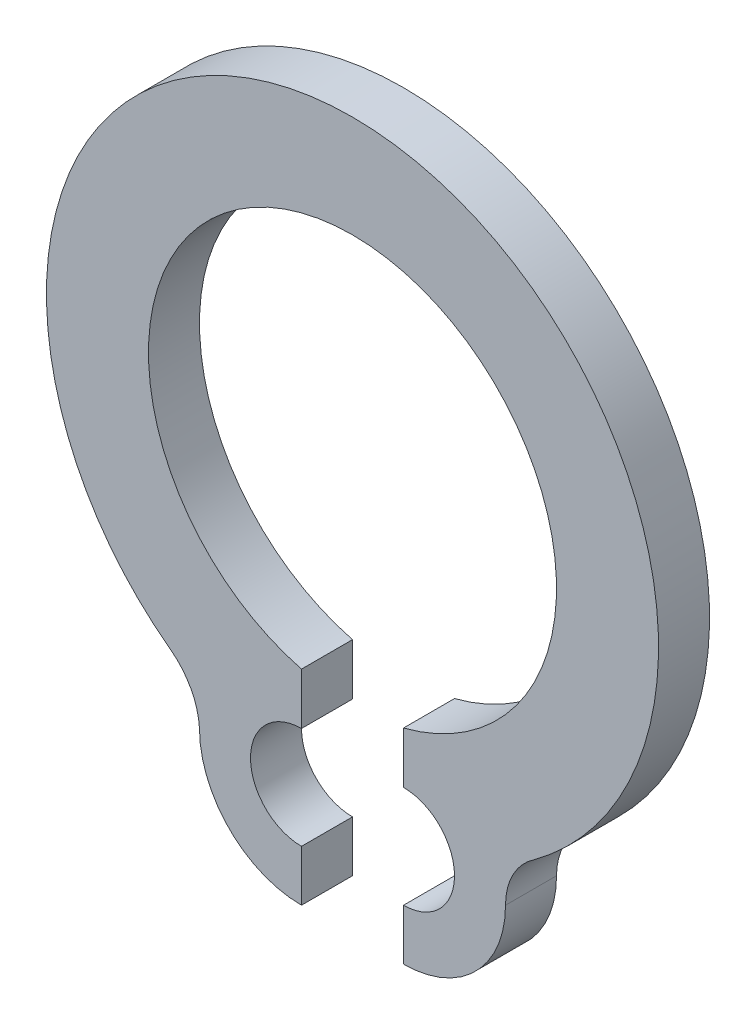
ISO-10303-21;
HEADER;
FILE_DESCRIPTION(('STEP AP214'),'2;1');
FILE_NAME('part.step','',(''),(''),'','','');
FILE_SCHEMA(('AUTOMOTIVE_DESIGN { 1 0 10303 214 1 1 1 1 }'));
ENDSEC;
DATA;
#1=APPLICATION_CONTEXT('core data for automotive mechanical design processes');
#2=APPLICATION_PROTOCOL_DEFINITION('international standard','automotive_design',2000,#1);
#3=PRODUCT_CONTEXT('',#1,'mechanical');
#4=PRODUCT('Part','Part','',(#3));
#5=PRODUCT_RELATED_PRODUCT_CATEGORY('part','',(#4));
#6=PRODUCT_DEFINITION_FORMATION('','',#4);
#7=PRODUCT_DEFINITION_CONTEXT('part definition',#1,'design');
#8=PRODUCT_DEFINITION('design','',#6,#7);
#9=PRODUCT_DEFINITION_SHAPE('','',#8);
#10=(LENGTH_UNIT() NAMED_UNIT(*) SI_UNIT(.MILLI.,.METRE.));
#11=(NAMED_UNIT(*) PLANE_ANGLE_UNIT() SI_UNIT($,.RADIAN.));
#12=(NAMED_UNIT(*) SI_UNIT($,.STERADIAN.) SOLID_ANGLE_UNIT());
#13=UNCERTAINTY_MEASURE_WITH_UNIT(LENGTH_MEASURE(1.E-05),#10,'distance_accuracy_value','');
#14=(GEOMETRIC_REPRESENTATION_CONTEXT(3) GLOBAL_UNCERTAINTY_ASSIGNED_CONTEXT((#13)) GLOBAL_UNIT_ASSIGNED_CONTEXT((#10,
#11,#12)) REPRESENTATION_CONTEXT('',''));
#15=CARTESIAN_POINT('',(0.,0.,0.));
#16=DIRECTION('',(0.,0.,1.));
#17=DIRECTION('',(1.,0.,0.));
#18=AXIS2_PLACEMENT_3D('',#15,#16,#17);
#19=CARTESIAN_POINT('',(0.,0.,0.5));
#20=DIRECTION('',(0.,0.,-1.));
#21=DIRECTION('',(-1.,0.,0.));
#22=AXIS2_PLACEMENT_3D('',#19,#20,#21);
#23=CYLINDRICAL_SURFACE('',#22,1.99999743054572);
#24=CARTESIAN_POINT('',(0.,0.,0.));
#25=DIRECTION('',(0.,0.,-1.));
#26=DIRECTION('',(-1.,0.,0.));
#27=AXIS2_PLACEMENT_3D('',#24,#25,#26);
#28=CIRCLE('',#27,1.99999743054572);
#29=CARTESIAN_POINT('',(-0.499989722083852,-1.93649167310371,0.));
#30=VERTEX_POINT('',#29);
#31=CARTESIAN_POINT('',(0.499989722083852,-1.93649167310371,0.));
#32=VERTEX_POINT('',#31);
#33=EDGE_CURVE('E152',#30,#32,#28,.T.);
#34=ORIENTED_EDGE('',*,*,#33,.T.);
#35=DIRECTION('',(0.,0.,-1.));
#36=VECTOR('',#35,1.);
#37=CARTESIAN_POINT('',(0.499989722083852,-1.93649167310371,0.5));
#38=LINE('',#37,#36);
#39=CARTESIAN_POINT('',(0.499989722083852,-1.93649167310371,0.5));
#40=VERTEX_POINT('',#39);
#41=EDGE_CURVE('E11',#40,#32,#38,.T.);
#42=ORIENTED_EDGE('',*,*,#41,.F.);
#43=CARTESIAN_POINT('',(0.,0.,0.5));
#44=DIRECTION('',(0.,0.,-1.));
#45=DIRECTION('',(-1.,0.,0.));
#46=AXIS2_PLACEMENT_3D('',#43,#44,#45);
#47=CIRCLE('',#46,1.99999743054572);
#48=CARTESIAN_POINT('',(-0.499989722083852,-1.93649167310371,0.5));
#49=VERTEX_POINT('',#48);
#50=EDGE_CURVE('E174',#49,#40,#47,.T.);
#51=ORIENTED_EDGE('',*,*,#50,.F.);
#52=DIRECTION('',(0.,0.,-1.));
#53=VECTOR('',#52,1.);
#54=CARTESIAN_POINT('',(-0.499989722083852,-1.93649167310371,0.5));
#55=LINE('',#54,#53);
#56=EDGE_CURVE('E148',#49,#30,#55,.T.);
#57=ORIENTED_EDGE('',*,*,#56,.T.);
#58=EDGE_LOOP('',(#34,#42,#51,#57));
#59=FACE_BOUND('',#58,.T.);
#60=ADVANCED_FACE('F32',(#59),#23,.F.);
#61=CARTESIAN_POINT('',(0.499989722083852,-2.44102553878064,0.5));
#62=DIRECTION('',(1.,0.,0.));
#63=DIRECTION('',(0.,0.,-1.));
#64=AXIS2_PLACEMENT_3D('',#61,#62,#63);
#65=PLANE('',#64);
#66=DIRECTION('',(0.,-1.,0.));
#67=VECTOR('',#66,1.);
#68=CARTESIAN_POINT('',(0.499989722083852,-2.44102553878064,0.));
#69=LINE('',#68,#67);
#70=CARTESIAN_POINT('',(0.499989722083852,-2.44102553878064,0.));
#71=VERTEX_POINT('',#70);
#72=EDGE_CURVE('E155',#32,#71,#69,.T.);
#73=ORIENTED_EDGE('',*,*,#72,.T.);
#74=DIRECTION('',(0.,0.,-1.));
#75=VECTOR('',#74,1.);
#76=CARTESIAN_POINT('',(0.499989722083852,-2.44102553878064,0.5));
#77=LINE('',#76,#75);
#78=CARTESIAN_POINT('',(0.499989722083852,-2.44102553878064,0.5));
#79=VERTEX_POINT('',#78);
#80=EDGE_CURVE('E40',#79,#71,#77,.T.);
#81=ORIENTED_EDGE('',*,*,#80,.F.);
#82=DIRECTION('',(0.,-1.,0.));
#83=VECTOR('',#82,1.);
#84=CARTESIAN_POINT('',(0.499989722083852,-2.44102553878064,0.5));
#85=LINE('',#84,#83);
#86=EDGE_CURVE('E103',#40,#79,#85,.T.);
#87=ORIENTED_EDGE('',*,*,#86,.F.);
#88=ORIENTED_EDGE('',*,*,#41,.T.);
#89=EDGE_LOOP('',(#73,#81,#87,#88));
#90=FACE_BOUND('',#89,.T.);
#91=ADVANCED_FACE('F252',(#90),#65,.F.);
#92=CARTESIAN_POINT('',(0.499989722083853,-2.94102553878303,0.5));
#93=DIRECTION('',(0.,0.,-1.));
#94=DIRECTION('',(-1.,0.,0.));
#95=AXIS2_PLACEMENT_3D('',#92,#93,#94);
#96=CYLINDRICAL_SURFACE('',#95,0.500000000002387);
#97=CARTESIAN_POINT('',(0.499989722083853,-2.94102553878303,0.));
#98=DIRECTION('',(0.,0.,-1.));
#99=DIRECTION('',(-1.,0.,0.));
#100=AXIS2_PLACEMENT_3D('',#97,#98,#99);
#101=CIRCLE('',#100,0.500000000002387);
#102=CARTESIAN_POINT('',(0.499989722083853,-3.44102553878541,0.));
#103=VERTEX_POINT('',#102);
#104=EDGE_CURVE('E157',#71,#103,#101,.T.);
#105=ORIENTED_EDGE('',*,*,#104,.T.);
#106=DIRECTION('',(0.,0.,-1.));
#107=VECTOR('',#106,1.);
#108=CARTESIAN_POINT('',(0.499989722083853,-3.44102553878541,0.5));
#109=LINE('',#108,#107);
#110=CARTESIAN_POINT('',(0.499989722083853,-3.44102553878541,0.5));
#111=VERTEX_POINT('',#110);
#112=EDGE_CURVE('E193',#111,#103,#109,.T.);
#113=ORIENTED_EDGE('',*,*,#112,.F.);
#114=CARTESIAN_POINT('',(0.499989722083853,-2.94102553878303,0.5));
#115=DIRECTION('',(0.,0.,-1.));
#116=DIRECTION('',(-1.,0.,0.));
#117=AXIS2_PLACEMENT_3D('',#114,#115,#116);
#118=CIRCLE('',#117,0.500000000002387);
#119=EDGE_CURVE('E201',#79,#111,#118,.T.);
#120=ORIENTED_EDGE('',*,*,#119,.F.);
#121=ORIENTED_EDGE('',*,*,#80,.T.);
#122=EDGE_LOOP('',(#105,#113,#120,#121));
#123=FACE_BOUND('',#122,.T.);
#124=ADVANCED_FACE('F199',(#123),#96,.F.);
#125=CARTESIAN_POINT('',(0.499989722083853,-3.44102553878541,0.5));
#126=DIRECTION('',(1.,0.,0.));
#127=DIRECTION('',(0.,1.,0.));
#128=AXIS2_PLACEMENT_3D('',#125,#126,#127);
#129=PLANE('',#128);
#130=DIRECTION('',(0.,-1.,0.));
#131=VECTOR('',#130,1.);
#132=CARTESIAN_POINT('',(0.499989722083853,-3.44102553878541,0.));
#133=LINE('',#132,#131);
#134=CARTESIAN_POINT('',(0.499989722083853,-3.94102553877359,0.));
#135=VERTEX_POINT('',#134);
#136=EDGE_CURVE('E159',#103,#135,#133,.T.);
#137=ORIENTED_EDGE('',*,*,#136,.T.);
#138=DIRECTION('',(0.,0.,-1.));
#139=VECTOR('',#138,1.);
#140=CARTESIAN_POINT('',(0.499989722083853,-3.94102553877359,0.5));
#141=LINE('',#140,#139);
#142=CARTESIAN_POINT('',(0.499989722083853,-3.94102553877359,0.5));
#143=VERTEX_POINT('',#142);
#144=EDGE_CURVE('E190',#143,#135,#141,.T.);
#145=ORIENTED_EDGE('',*,*,#144,.F.);
#146=DIRECTION('',(0.,-1.,0.));
#147=VECTOR('',#146,1.);
#148=CARTESIAN_POINT('',(0.499989722083853,-3.44102553878541,0.5));
#149=LINE('',#148,#147);
#150=EDGE_CURVE('E219',#111,#143,#149,.T.);
#151=ORIENTED_EDGE('',*,*,#150,.F.);
#152=ORIENTED_EDGE('',*,*,#112,.T.);
#153=EDGE_LOOP('',(#137,#145,#151,#152));
#154=FACE_BOUND('',#153,.T.);
#155=ADVANCED_FACE('F210',(#154),#129,.F.);
#156=CARTESIAN_POINT('',(0.499989722083853,-2.94101526085744,0.5));
#157=DIRECTION('',(0.,0.,-1.));
#158=DIRECTION('',(-1.,0.,0.));
#159=AXIS2_PLACEMENT_3D('',#156,#157,#158);
#160=CYLINDRICAL_SURFACE('',#159,1.00001027791615);
#161=CARTESIAN_POINT('',(0.499989722083853,-2.94101526085744,0.));
#162=DIRECTION('',(0.,0.,1.));
#163=DIRECTION('',(1.,0.,0.));
#164=AXIS2_PLACEMENT_3D('',#161,#162,#163);
#165=CIRCLE('',#164,1.00001027791615);
#166=CARTESIAN_POINT('',(1.5,-2.94101526085744,0.));
#167=VERTEX_POINT('',#166);
#168=EDGE_CURVE('E161',#135,#167,#165,.T.);
#169=ORIENTED_EDGE('',*,*,#168,.T.);
#170=DIRECTION('',(0.,0.,-1.));
#171=VECTOR('',#170,1.);
#172=CARTESIAN_POINT('',(1.5,-2.94101526085744,0.5));
#173=LINE('',#172,#171);
#174=CARTESIAN_POINT('',(1.5,-2.94101526085744,0.5));
#175=VERTEX_POINT('',#174);
#176=EDGE_CURVE('E187',#175,#167,#173,.T.);
#177=ORIENTED_EDGE('',*,*,#176,.F.);
#178=CARTESIAN_POINT('',(0.499989722083853,-2.94101526085744,0.5));
#179=DIRECTION('',(0.,0.,1.));
#180=DIRECTION('',(1.,0.,0.));
#181=AXIS2_PLACEMENT_3D('',#178,#179,#180);
#182=CIRCLE('',#181,1.00001027791615);
#183=EDGE_CURVE('E216',#143,#175,#182,.T.);
#184=ORIENTED_EDGE('',*,*,#183,.F.);
#185=ORIENTED_EDGE('',*,*,#144,.T.);
#186=EDGE_LOOP('',(#169,#177,#184,#185));
#187=FACE_BOUND('',#186,.T.);
#188=ADVANCED_FACE('F214',(#187),#160,.T.);
#189=CARTESIAN_POINT('',(2.13526728597302,-2.94101526085744,0.5));
#190=DIRECTION('',(0.,0.,-1.));
#191=DIRECTION('',(-1.,0.,0.));
#192=AXIS2_PLACEMENT_3D('',#189,#190,#191);
#193=CYLINDRICAL_SURFACE('',#192,0.63526728597302);
#194=CARTESIAN_POINT('',(2.13526728597302,-2.94101526085744,0.));
#195=DIRECTION('',(0.,0.,-1.));
#196=DIRECTION('',(-1.,0.,0.));
#197=AXIS2_PLACEMENT_3D('',#194,#195,#196);
#198=CIRCLE('',#197,0.63526728597302);
#199=CARTESIAN_POINT('',(1.78670781291138,-2.40991186379947,0.));
#200=VERTEX_POINT('',#199);
#201=EDGE_CURVE('E163',#167,#200,#198,.T.);
#202=ORIENTED_EDGE('',*,*,#201,.T.);
#203=DIRECTION('',(0.,0.,-1.));
#204=VECTOR('',#203,1.);
#205=CARTESIAN_POINT('',(1.78670781291138,-2.40991186379947,0.5));
#206=LINE('',#205,#204);
#207=CARTESIAN_POINT('',(1.78670781291138,-2.40991186379947,0.5));
#208=VERTEX_POINT('',#207);
#209=EDGE_CURVE('E184',#208,#200,#206,.T.);
#210=ORIENTED_EDGE('',*,*,#209,.F.);
#211=CARTESIAN_POINT('',(2.13526728597302,-2.94101526085744,0.5));
#212=DIRECTION('',(0.,0.,-1.));
#213=DIRECTION('',(-1.,0.,0.));
#214=AXIS2_PLACEMENT_3D('',#211,#212,#213);
#215=CIRCLE('',#214,0.63526728597302);
#216=EDGE_CURVE('E218',#175,#208,#215,.T.);
#217=ORIENTED_EDGE('',*,*,#216,.F.);
#218=ORIENTED_EDGE('',*,*,#176,.T.);
#219=EDGE_LOOP('',(#202,#210,#217,#218));
#220=FACE_BOUND('',#219,.T.);
#221=ADVANCED_FACE('F265',(#220),#193,.F.);
#222=CARTESIAN_POINT('',(0.,0.,0.5));
#223=DIRECTION('',(0.,0.,-1.));
#224=DIRECTION('',(-1.,0.,0.));
#225=AXIS2_PLACEMENT_3D('',#222,#223,#224);
#226=CYLINDRICAL_SURFACE('',#225,3.);
#227=CARTESIAN_POINT('',(0.,0.,0.));
#228=DIRECTION('',(0.,0.,1.));
#229=DIRECTION('',(-1.,0.,0.));
#230=AXIS2_PLACEMENT_3D('',#227,#228,#229);
#231=CIRCLE('',#230,3.);
#232=CARTESIAN_POINT('',(-1.78670781291138,-2.40991186379947,0.));
#233=VERTEX_POINT('',#232);
#234=EDGE_CURVE('E165',#200,#233,#231,.T.);
#235=ORIENTED_EDGE('',*,*,#234,.T.);
#236=DIRECTION('',(0.,0.,-1.));
#237=VECTOR('',#236,1.);
#238=CARTESIAN_POINT('',(-1.78670781291138,-2.40991186379947,0.5));
#239=LINE('',#238,#237);
#240=CARTESIAN_POINT('',(-1.78670781291138,-2.40991186379947,0.5));
#241=VERTEX_POINT('',#240);
#242=EDGE_CURVE('E181',#241,#233,#239,.T.);
#243=ORIENTED_EDGE('',*,*,#242,.F.);
#244=CARTESIAN_POINT('',(0.,0.,0.5));
#245=DIRECTION('',(0.,0.,1.));
#246=DIRECTION('',(-1.,0.,0.));
#247=AXIS2_PLACEMENT_3D('',#244,#245,#246);
#248=CIRCLE('',#247,3.);
#249=EDGE_CURVE('E221',#208,#241,#248,.T.);
#250=ORIENTED_EDGE('',*,*,#249,.F.);
#251=ORIENTED_EDGE('',*,*,#209,.T.);
#252=EDGE_LOOP('',(#235,#243,#250,#251));
#253=FACE_BOUND('',#252,.T.);
#254=ADVANCED_FACE('F268',(#253),#226,.T.);
#255=CARTESIAN_POINT('',(-2.21063054365775,-2.98169892980846,0.5));
#256=DIRECTION('',(0.,0.,-1.));
#257=DIRECTION('',(-1.,0.,0.));
#258=AXIS2_PLACEMENT_3D('',#255,#256,#257);
#259=CYLINDRICAL_SURFACE('',#258,0.71179416301247);
#260=CARTESIAN_POINT('',(-2.21063054365775,-2.98169892980846,0.));
#261=DIRECTION('',(0.,0.,-1.));
#262=DIRECTION('',(-1.,0.,0.));
#263=AXIS2_PLACEMENT_3D('',#260,#261,#262);
#264=CIRCLE('',#263,0.71179416301247);
#265=CARTESIAN_POINT('',(-1.5,-2.94101526085744,0.));
#266=VERTEX_POINT('',#265);
#267=EDGE_CURVE('E167',#233,#266,#264,.T.);
#268=ORIENTED_EDGE('',*,*,#267,.T.);
#269=DIRECTION('',(0.,0.,-1.));
#270=VECTOR('',#269,1.);
#271=CARTESIAN_POINT('',(-1.5,-2.94101526085744,0.5));
#272=LINE('',#271,#270);
#273=CARTESIAN_POINT('',(-1.5,-2.94101526085744,0.5));
#274=VERTEX_POINT('',#273);
#275=EDGE_CURVE('E178',#274,#266,#272,.T.);
#276=ORIENTED_EDGE('',*,*,#275,.F.);
#277=CARTESIAN_POINT('',(-2.21063054365775,-2.98169892980846,0.5));
#278=DIRECTION('',(0.,0.,-1.));
#279=DIRECTION('',(-1.,0.,0.));
#280=AXIS2_PLACEMENT_3D('',#277,#278,#279);
#281=CIRCLE('',#280,0.71179416301247);
#282=EDGE_CURVE('E227',#241,#274,#281,.T.);
#283=ORIENTED_EDGE('',*,*,#282,.F.);
#284=ORIENTED_EDGE('',*,*,#242,.T.);
#285=EDGE_LOOP('',(#268,#276,#283,#284));
#286=FACE_BOUND('',#285,.T.);
#287=ADVANCED_FACE('F233',(#286),#259,.F.);
#288=CARTESIAN_POINT('',(-0.499989722083853,-2.94101526085744,0.5));
#289=DIRECTION('',(0.,0.,-1.));
#290=DIRECTION('',(-1.,0.,0.));
#291=AXIS2_PLACEMENT_3D('',#288,#289,#290);
#292=CYLINDRICAL_SURFACE('',#291,1.00001027791615);
#293=CARTESIAN_POINT('',(-0.499989722083853,-2.94101526085744,0.));
#294=DIRECTION('',(0.,0.,1.));
#295=DIRECTION('',(-1.,0.,0.));
#296=AXIS2_PLACEMENT_3D('',#293,#294,#295);
#297=CIRCLE('',#296,1.00001027791615);
#298=CARTESIAN_POINT('',(-0.499989722083852,-3.94102553877359,0.));
#299=VERTEX_POINT('',#298);
#300=EDGE_CURVE('E169',#266,#299,#297,.T.);
#301=ORIENTED_EDGE('',*,*,#300,.T.);
#302=DIRECTION('',(0.,0.,-1.));
#303=VECTOR('',#302,1.);
#304=CARTESIAN_POINT('',(-0.499989722083852,-3.94102553877359,0.5));
#305=LINE('',#304,#303);
#306=CARTESIAN_POINT('',(-0.499989722083852,-3.94102553877359,0.5));
#307=VERTEX_POINT('',#306);
#308=EDGE_CURVE('E143',#307,#299,#305,.T.);
#309=ORIENTED_EDGE('',*,*,#308,.F.);
#310=CARTESIAN_POINT('',(-0.499989722083853,-2.94101526085744,0.5));
#311=DIRECTION('',(0.,0.,1.));
#312=DIRECTION('',(-1.,0.,0.));
#313=AXIS2_PLACEMENT_3D('',#310,#311,#312);
#314=CIRCLE('',#313,1.00001027791615);
#315=EDGE_CURVE('E134',#274,#307,#314,.T.);
#316=ORIENTED_EDGE('',*,*,#315,.F.);
#317=ORIENTED_EDGE('',*,*,#275,.T.);
#318=EDGE_LOOP('',(#301,#309,#316,#317));
#319=FACE_BOUND('',#318,.T.);
#320=ADVANCED_FACE('F237',(#319),#292,.T.);
#321=CARTESIAN_POINT('',(-0.499989722083853,-3.44102553878541,0.5));
#322=DIRECTION('',(-1.,0.,0.));
#323=DIRECTION('',(0.,-1.,0.));
#324=AXIS2_PLACEMENT_3D('',#321,#322,#323);
#325=PLANE('',#324);
#326=DIRECTION('',(0.,1.,0.));
#327=VECTOR('',#326,1.);
#328=CARTESIAN_POINT('',(-0.499989722083853,-3.44102553878541,0.));
#329=LINE('',#328,#327);
#330=CARTESIAN_POINT('',(-0.499989722083853,-3.44102553878541,0.));
#331=VERTEX_POINT('',#330);
#332=EDGE_CURVE('E142',#299,#331,#329,.T.);
#333=ORIENTED_EDGE('',*,*,#332,.T.);
#334=DIRECTION('',(0.,0.,-1.));
#335=VECTOR('',#334,1.);
#336=CARTESIAN_POINT('',(-0.499989722083853,-3.44102553878541,0.5));
#337=LINE('',#336,#335);
#338=CARTESIAN_POINT('',(-0.499989722083853,-3.44102553878541,0.5));
#339=VERTEX_POINT('',#338);
#340=EDGE_CURVE('E139',#339,#331,#337,.T.);
#341=ORIENTED_EDGE('',*,*,#340,.F.);
#342=DIRECTION('',(0.,1.,0.));
#343=VECTOR('',#342,1.);
#344=CARTESIAN_POINT('',(-0.499989722083853,-3.44102553878541,0.5));
#345=LINE('',#344,#343);
#346=EDGE_CURVE('E128',#307,#339,#345,.T.);
#347=ORIENTED_EDGE('',*,*,#346,.F.);
#348=ORIENTED_EDGE('',*,*,#308,.T.);
#349=EDGE_LOOP('',(#333,#341,#347,#348));
#350=FACE_BOUND('',#349,.T.);
#351=ADVANCED_FACE('F140',(#350),#325,.F.);
#352=CARTESIAN_POINT('',(-0.499989722083853,-2.9410255387712,0.5));
#353=DIRECTION('',(0.,0.,-1.));
#354=DIRECTION('',(-1.,0.,0.));
#355=AXIS2_PLACEMENT_3D('',#352,#353,#354);
#356=CYLINDRICAL_SURFACE('',#355,0.500000000002387);
#357=CARTESIAN_POINT('',(-0.499989722083853,-2.9410255387712,0.));
#358=DIRECTION('',(0.,0.,-1.));
#359=DIRECTION('',(1.,0.,0.));
#360=AXIS2_PLACEMENT_3D('',#357,#358,#359);
#361=CIRCLE('',#360,0.500000000002387);
#362=CARTESIAN_POINT('',(-0.499989722083852,-2.44102553876881,0.));
#363=VERTEX_POINT('',#362);
#364=EDGE_CURVE('E89',#331,#363,#361,.T.);
#365=ORIENTED_EDGE('',*,*,#364,.T.);
#366=DIRECTION('',(0.,0.,-1.));
#367=VECTOR('',#366,1.);
#368=CARTESIAN_POINT('',(-0.499989722083852,-2.44102553876881,0.5));
#369=LINE('',#368,#367);
#370=CARTESIAN_POINT('',(-0.499989722083852,-2.44102553876881,0.5));
#371=VERTEX_POINT('',#370);
#372=EDGE_CURVE('E144',#371,#363,#369,.T.);
#373=ORIENTED_EDGE('',*,*,#372,.F.);
#374=CARTESIAN_POINT('',(-0.499989722083853,-2.9410255387712,0.5));
#375=DIRECTION('',(0.,0.,-1.));
#376=DIRECTION('',(1.,0.,0.));
#377=AXIS2_PLACEMENT_3D('',#374,#375,#376);
#378=CIRCLE('',#377,0.500000000002387);
#379=EDGE_CURVE('E132',#339,#371,#378,.T.);
#380=ORIENTED_EDGE('',*,*,#379,.F.);
#381=ORIENTED_EDGE('',*,*,#340,.T.);
#382=EDGE_LOOP('',(#365,#373,#380,#381));
#383=FACE_BOUND('',#382,.T.);
#384=ADVANCED_FACE('F146',(#383),#356,.F.);
#385=CARTESIAN_POINT('',(-0.499989722083852,-2.44102553878064,0.5));
#386=DIRECTION('',(-1.,0.,0.));
#387=DIRECTION('',(0.,-1.,0.));
#388=AXIS2_PLACEMENT_3D('',#385,#386,#387);
#389=PLANE('',#388);
#390=DIRECTION('',(0.,1.,0.));
#391=VECTOR('',#390,1.);
#392=CARTESIAN_POINT('',(-0.499989722083852,-2.44102553878064,0.));
#393=LINE('',#392,#391);
#394=EDGE_CURVE('E95',#363,#30,#393,.T.);
#395=ORIENTED_EDGE('',*,*,#394,.T.);
#396=ORIENTED_EDGE('',*,*,#56,.F.);
#397=DIRECTION('',(0.,1.,0.));
#398=VECTOR('',#397,1.);
#399=CARTESIAN_POINT('',(-0.499989722083852,-2.44102553878064,0.5));
#400=LINE('',#399,#398);
#401=EDGE_CURVE('E48',#371,#49,#400,.T.);
#402=ORIENTED_EDGE('',*,*,#401,.F.);
#403=ORIENTED_EDGE('',*,*,#372,.T.);
#404=EDGE_LOOP('',(#395,#396,#402,#403));
#405=FACE_BOUND('',#404,.T.);
#406=ADVANCED_FACE('F241',(#405),#389,.F.);
#407=CARTESIAN_POINT('',(0.,0.,0.5));
#408=DIRECTION('',(0.,0.,-1.));
#409=DIRECTION('',(-1.,0.,0.));
#410=AXIS2_PLACEMENT_3D('',#407,#408,#409);
#411=PLANE('',#410);
#412=ORIENTED_EDGE('',*,*,#50,.T.);
#413=ORIENTED_EDGE('',*,*,#86,.T.);
#414=ORIENTED_EDGE('',*,*,#119,.T.);
#415=ORIENTED_EDGE('',*,*,#150,.T.);
#416=ORIENTED_EDGE('',*,*,#183,.T.);
#417=ORIENTED_EDGE('',*,*,#216,.T.);
#418=ORIENTED_EDGE('',*,*,#249,.T.);
#419=ORIENTED_EDGE('',*,*,#282,.T.);
#420=ORIENTED_EDGE('',*,*,#315,.T.);
#421=ORIENTED_EDGE('',*,*,#346,.T.);
#422=ORIENTED_EDGE('',*,*,#379,.T.);
#423=ORIENTED_EDGE('',*,*,#401,.T.);
#424=EDGE_LOOP('',(#412,#413,#414,#415,#416,#417,#418,#419,#420,#421,#422,#423));
#425=FACE_BOUND('',#424,.T.);
#426=ADVANCED_FACE('F130',(#425),#411,.F.);
#427=CARTESIAN_POINT('',(0.,0.,0.));
#428=DIRECTION('',(0.,0.,-1.));
#429=DIRECTION('',(-1.,0.,0.));
#430=AXIS2_PLACEMENT_3D('',#427,#428,#429);
#431=PLANE('',#430);
#432=ORIENTED_EDGE('',*,*,#33,.F.);
#433=ORIENTED_EDGE('',*,*,#394,.F.);
#434=ORIENTED_EDGE('',*,*,#364,.F.);
#435=ORIENTED_EDGE('',*,*,#332,.F.);
#436=ORIENTED_EDGE('',*,*,#300,.F.);
#437=ORIENTED_EDGE('',*,*,#267,.F.);
#438=ORIENTED_EDGE('',*,*,#234,.F.);
#439=ORIENTED_EDGE('',*,*,#201,.F.);
#440=ORIENTED_EDGE('',*,*,#168,.F.);
#441=ORIENTED_EDGE('',*,*,#136,.F.);
#442=ORIENTED_EDGE('',*,*,#104,.F.);
#443=ORIENTED_EDGE('',*,*,#72,.F.);
#444=EDGE_LOOP('',(#432,#433,#434,#435,#436,#437,#438,#439,#440,#441,#442,#443));
#445=FACE_BOUND('',#444,.T.);
#446=ADVANCED_FACE('F205',(#445),#431,.T.);
#447=CLOSED_SHELL('',(#60,#91,#124,#155,#188,#221,#254,#287,#320,#351,#384,#406,#426,#446));
#448=MANIFOLD_SOLID_BREP('B2',#447);
#449=ADVANCED_BREP_SHAPE_REPRESENTATION('',(#18,#448),#14);
#450=SHAPE_DEFINITION_REPRESENTATION(#9,#449);
ENDSEC;
END-ISO-10303-21;
